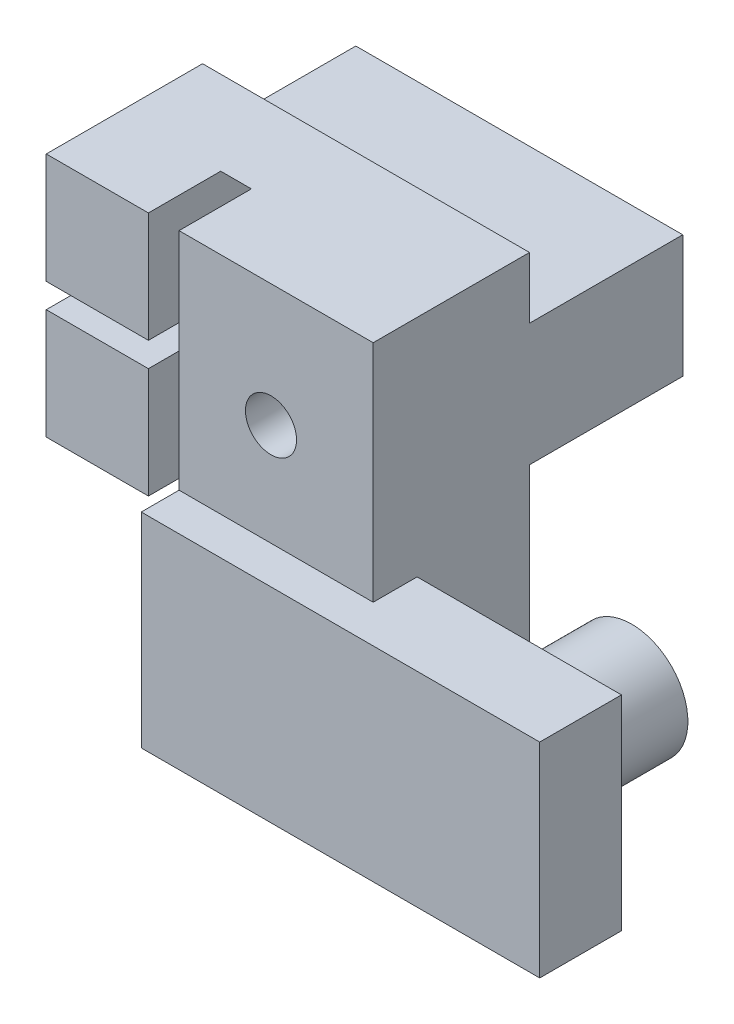
ISO-10303-21;
HEADER;
FILE_DESCRIPTION(('STEP AP214'),'2;1');
FILE_NAME('part.step','',(''),(''),'','','');
FILE_SCHEMA(('AUTOMOTIVE_DESIGN { 1 0 10303 214 1 1 1 1 }'));
ENDSEC;
DATA;
#1=APPLICATION_CONTEXT('core data for automotive mechanical design processes');
#2=APPLICATION_PROTOCOL_DEFINITION('international standard','automotive_design',2000,#1);
#3=PRODUCT_CONTEXT('',#1,'mechanical');
#4=PRODUCT('Part','Part','',(#3));
#5=PRODUCT_RELATED_PRODUCT_CATEGORY('part','',(#4));
#6=PRODUCT_DEFINITION_FORMATION('','',#4);
#7=PRODUCT_DEFINITION_CONTEXT('part definition',#1,'design');
#8=PRODUCT_DEFINITION('design','',#6,#7);
#9=PRODUCT_DEFINITION_SHAPE('','',#8);
#10=(LENGTH_UNIT() NAMED_UNIT(*) SI_UNIT(.MILLI.,.METRE.));
#11=(NAMED_UNIT(*) PLANE_ANGLE_UNIT() SI_UNIT($,.RADIAN.));
#12=(NAMED_UNIT(*) SI_UNIT($,.STERADIAN.) SOLID_ANGLE_UNIT());
#13=UNCERTAINTY_MEASURE_WITH_UNIT(LENGTH_MEASURE(1.E-05),#10,'distance_accuracy_value','');
#14=(GEOMETRIC_REPRESENTATION_CONTEXT(3) GLOBAL_UNCERTAINTY_ASSIGNED_CONTEXT((#13)) GLOBAL_UNIT_ASSIGNED_CONTEXT((#10,
#11,#12)) REPRESENTATION_CONTEXT('',''));
#15=CARTESIAN_POINT('',(0.,0.,0.));
#16=DIRECTION('',(0.,0.,1.));
#17=DIRECTION('',(1.,0.,0.));
#18=AXIS2_PLACEMENT_3D('',#15,#16,#17);
#19=CARTESIAN_POINT('',(-21.5996936960818,19.,27.65));
#20=DIRECTION('',(0.,1.,0.));
#21=DIRECTION('',(0.,0.,1.));
#22=AXIS2_PLACEMENT_3D('',#19,#20,#21);
#23=PLANE('',#22);
#24=DIRECTION('',(0.,0.,-1.));
#25=VECTOR('',#24,1.);
#26=CARTESIAN_POINT('',(-15.0996936960818,19.,7.65));
#27=LINE('',#26,#25);
#28=CARTESIAN_POINT('',(-15.0996936960818,19.,4.11123412892984));
#29=VERTEX_POINT('',#28);
#30=CARTESIAN_POINT('',(-15.0996936960818,19.,0.));
#31=VERTEX_POINT('',#30);
#32=EDGE_CURVE('E11',#29,#31,#27,.T.);
#33=ORIENTED_EDGE('',*,*,#32,.F.);
#34=DIRECTION('',(-1.,0.,0.));
#35=VECTOR('',#34,1.);
#36=CARTESIAN_POINT('',(-15.0996936960818,19.,4.11123412892984));
#37=LINE('',#36,#35);
#38=CARTESIAN_POINT('',(-16.5996936960818,19.,4.11123412892984));
#39=VERTEX_POINT('',#38);
#40=EDGE_CURVE('E299',#29,#39,#37,.T.);
#41=ORIENTED_EDGE('',*,*,#40,.T.);
#42=DIRECTION('',(0.,0.,1.));
#43=VECTOR('',#42,1.);
#44=CARTESIAN_POINT('',(-16.5996936960818,19.,27.65));
#45=LINE('',#44,#43);
#46=CARTESIAN_POINT('',(-16.5996936960818,19.,7.65));
#47=VERTEX_POINT('',#46);
#48=EDGE_CURVE('E290',#39,#47,#45,.T.);
#49=ORIENTED_EDGE('',*,*,#48,.T.);
#50=DIRECTION('',(1.,0.,0.));
#51=VECTOR('',#50,1.);
#52=CARTESIAN_POINT('',(-21.5996936960818,19.,7.65));
#53=LINE('',#52,#51);
#54=CARTESIAN_POINT('',(-21.5996936960818,19.,7.65));
#55=VERTEX_POINT('',#54);
#56=EDGE_CURVE('E348',#55,#47,#53,.T.);
#57=ORIENTED_EDGE('',*,*,#56,.F.);
#58=DIRECTION('',(0.,0.,-1.));
#59=VECTOR('',#58,1.);
#60=CARTESIAN_POINT('',(-21.5996936960818,19.,27.65));
#61=LINE('',#60,#59);
#62=CARTESIAN_POINT('',(-21.5996936960818,19.,0.));
#63=VERTEX_POINT('',#62);
#64=EDGE_CURVE('E340',#55,#63,#61,.T.);
#65=ORIENTED_EDGE('',*,*,#64,.T.);
#66=DIRECTION('',(1.,0.,0.));
#67=VECTOR('',#66,1.);
#68=CARTESIAN_POINT('',(-21.5996936960818,19.,0.));
#69=LINE('',#68,#67);
#70=EDGE_CURVE('E338',#63,#31,#69,.T.);
#71=ORIENTED_EDGE('',*,*,#70,.T.);
#72=EDGE_LOOP('',(#33,#41,#49,#57,#65,#71));
#73=FACE_BOUND('',#72,.T.);
#74=ADVANCED_FACE('F45',(#73),#23,.F.);
#75=CARTESIAN_POINT('',(0.,0.,0.));
#76=DIRECTION('',(0.,0.,-1.));
#77=DIRECTION('',(-1.,0.,0.));
#78=AXIS2_PLACEMENT_3D('',#75,#76,#77);
#79=PLANE('',#78);
#80=DIRECTION('',(1.,0.,0.));
#81=VECTOR('',#80,1.);
#82=CARTESIAN_POINT('',(-5.59969369608177,28.,0.));
#83=LINE('',#82,#81);
#84=CARTESIAN_POINT('',(-21.5996936960818,28.,0.));
#85=VERTEX_POINT('',#84);
#86=CARTESIAN_POINT('',(-5.59969369608177,28.,0.));
#87=VERTEX_POINT('',#86);
#88=EDGE_CURVE('E261',#85,#87,#83,.T.);
#89=ORIENTED_EDGE('',*,*,#88,.F.);
#90=DIRECTION('',(0.,-1.,0.));
#91=VECTOR('',#90,1.);
#92=CARTESIAN_POINT('',(-21.5996936960818,19.,0.));
#93=LINE('',#92,#91);
#94=CARTESIAN_POINT('',(-21.5996936960818,31.,0.));
#95=VERTEX_POINT('',#94);
#96=EDGE_CURVE('E341',#95,#85,#93,.T.);
#97=ORIENTED_EDGE('',*,*,#96,.F.);
#98=DIRECTION('',(-1.,0.,0.));
#99=VECTOR('',#98,1.);
#100=CARTESIAN_POINT('',(-21.5996936960818,31.,0.));
#101=LINE('',#100,#99);
#102=CARTESIAN_POINT('',(-5.59969369608177,31.,0.));
#103=VERTEX_POINT('',#102);
#104=EDGE_CURVE('E330',#103,#95,#101,.T.);
#105=ORIENTED_EDGE('',*,*,#104,.F.);
#106=DIRECTION('',(0.,1.,0.));
#107=VECTOR('',#106,1.);
#108=CARTESIAN_POINT('',(-5.59969369608177,19.,0.));
#109=LINE('',#108,#107);
#110=EDGE_CURVE('E69',#87,#103,#109,.T.);
#111=ORIENTED_EDGE('',*,*,#110,.F.);
#112=EDGE_LOOP('',(#89,#97,#105,#111));
#113=FACE_BOUND('',#112,.T.);
#114=ADVANCED_FACE('F413',(#113),#79,.T.);
#115=CARTESIAN_POINT('',(-21.5996936960818,31.,27.65));
#116=DIRECTION('',(0.,-1.,0.));
#117=DIRECTION('',(0.,0.,-1.));
#118=AXIS2_PLACEMENT_3D('',#115,#116,#117);
#119=PLANE('',#118);
#120=DIRECTION('',(0.,0.,-1.));
#121=VECTOR('',#120,1.);
#122=CARTESIAN_POINT('',(-15.0996936960818,31.,27.65));
#123=LINE('',#122,#121);
#124=CARTESIAN_POINT('',(-15.0996936960818,31.,7.65));
#125=VERTEX_POINT('',#124);
#126=CARTESIAN_POINT('',(-15.0996936960818,31.,4.11123412892984));
#127=VERTEX_POINT('',#126);
#128=EDGE_CURVE('E297',#125,#127,#123,.T.);
#129=ORIENTED_EDGE('',*,*,#128,.F.);
#130=DIRECTION('',(-1.,0.,0.));
#131=VECTOR('',#130,1.);
#132=CARTESIAN_POINT('',(-21.5996936960818,31.,7.65));
#133=LINE('',#132,#131);
#134=CARTESIAN_POINT('',(-5.59969369608177,31.,7.65));
#135=VERTEX_POINT('',#134);
#136=EDGE_CURVE('E355',#135,#125,#133,.T.);
#137=ORIENTED_EDGE('',*,*,#136,.F.);
#138=DIRECTION('',(0.,0.,-1.));
#139=VECTOR('',#138,1.);
#140=CARTESIAN_POINT('',(-5.59969369608177,31.,27.65));
#141=LINE('',#140,#139);
#142=EDGE_CURVE('E334',#135,#103,#141,.T.);
#143=ORIENTED_EDGE('',*,*,#142,.T.);
#144=ORIENTED_EDGE('',*,*,#104,.T.);
#145=DIRECTION('',(0.,0.,-1.));
#146=VECTOR('',#145,1.);
#147=CARTESIAN_POINT('',(-21.5996936960818,31.,27.65));
#148=LINE('',#147,#146);
#149=CARTESIAN_POINT('',(-21.5996936960818,31.,7.65));
#150=VERTEX_POINT('',#149);
#151=EDGE_CURVE('E323',#150,#95,#148,.T.);
#152=ORIENTED_EDGE('',*,*,#151,.F.);
#153=CARTESIAN_POINT('',(-16.5996936960818,31.,7.65));
#154=VERTEX_POINT('',#153);
#155=EDGE_CURVE('E333',#154,#150,#133,.T.);
#156=ORIENTED_EDGE('',*,*,#155,.F.);
#157=DIRECTION('',(0.,0.,-1.));
#158=VECTOR('',#157,1.);
#159=CARTESIAN_POINT('',(-16.5996936960818,31.,27.65));
#160=LINE('',#159,#158);
#161=CARTESIAN_POINT('',(-16.5996936960818,31.,4.11123412892984));
#162=VERTEX_POINT('',#161);
#163=EDGE_CURVE('E294',#154,#162,#160,.T.);
#164=ORIENTED_EDGE('',*,*,#163,.T.);
#165=DIRECTION('',(-1.,0.,0.));
#166=VECTOR('',#165,1.);
#167=CARTESIAN_POINT('',(-15.0996936960818,31.,4.11123412892984));
#168=LINE('',#167,#166);
#169=EDGE_CURVE('E49',#162,#127,#168,.F.);
#170=ORIENTED_EDGE('',*,*,#169,.T.);
#171=EDGE_LOOP('',(#129,#137,#143,#144,#152,#156,#164,#170));
#172=FACE_BOUND('',#171,.T.);
#173=ADVANCED_FACE('F368',(#172),#119,.F.);
#174=CARTESIAN_POINT('',(-94.7383382518,25.35,7.65));
#175=DIRECTION('',(0.,0.,1.));
#176=DIRECTION('',(0.,1.,0.));
#177=AXIS2_PLACEMENT_3D('',#174,#175,#176);
#178=PLANE('',#177);
#179=DIRECTION('',(-1.,0.,0.));
#180=VECTOR('',#179,1.);
#181=CARTESIAN_POINT('',(-94.7383382518,20.,7.65));
#182=LINE('',#181,#180);
#183=CARTESIAN_POINT('',(-5.59969369608177,20.,7.65));
#184=VERTEX_POINT('',#183);
#185=CARTESIAN_POINT('',(-15.0996936960818,20.,7.65));
#186=VERTEX_POINT('',#185);
#187=EDGE_CURVE('E231',#184,#186,#182,.T.);
#188=ORIENTED_EDGE('',*,*,#187,.F.);
#189=DIRECTION('',(0.,1.,0.));
#190=VECTOR('',#189,1.);
#191=CARTESIAN_POINT('',(-5.59969369608177,19.,7.65));
#192=LINE('',#191,#190);
#193=EDGE_CURVE('E345',#184,#135,#192,.T.);
#194=ORIENTED_EDGE('',*,*,#193,.T.);
#195=ORIENTED_EDGE('',*,*,#136,.T.);
#196=DIRECTION('',(0.,-1.,0.));
#197=VECTOR('',#196,1.);
#198=CARTESIAN_POINT('',(-15.0996936960818,25.35,7.65));
#199=LINE('',#198,#197);
#200=EDGE_CURVE('E347',#125,#186,#199,.T.);
#201=ORIENTED_EDGE('',*,*,#200,.T.);
#202=EDGE_LOOP('',(#188,#194,#195,#201));
#203=FACE_BOUND('',#202,.T.);
#204=CARTESIAN_POINT('',(-10.5996936960818,25.,7.65));
#205=DIRECTION('',(0.,0.,-1.));
#206=DIRECTION('',(-1.,0.,0.));
#207=AXIS2_PLACEMENT_3D('',#204,#205,#206);
#208=CIRCLE('',#207,1.25);
#209=CARTESIAN_POINT('',(-11.8496936960818,25.,7.65));
#210=VERTEX_POINT('',#209);
#211=EDGE_CURVE('E245',#210,#210,#208,.T.);
#212=ORIENTED_EDGE('',*,*,#211,.T.);
#213=EDGE_LOOP('',(#212));
#214=FACE_BOUND('',#213,.T.);
#215=ADVANCED_FACE('F409',(#203,#214),#178,.T.);
#216=DIRECTION('',(0.,-1.,0.));
#217=VECTOR('',#216,1.);
#218=CARTESIAN_POINT('',(-16.5996936960818,25.35,7.65));
#219=LINE('',#218,#217);
#220=CARTESIAN_POINT('',(-16.5996936960818,25.6,7.65));
#221=VERTEX_POINT('',#220);
#222=EDGE_CURVE('E291',#154,#221,#219,.T.);
#223=ORIENTED_EDGE('',*,*,#222,.F.);
#224=ORIENTED_EDGE('',*,*,#155,.T.);
#225=DIRECTION('',(0.,-1.,0.));
#226=VECTOR('',#225,1.);
#227=CARTESIAN_POINT('',(-21.5996936960818,19.,7.65));
#228=LINE('',#227,#226);
#229=CARTESIAN_POINT('',(-21.5996936960818,25.6,7.65));
#230=VERTEX_POINT('',#229);
#231=EDGE_CURVE('E351',#150,#230,#228,.T.);
#232=ORIENTED_EDGE('',*,*,#231,.T.);
#233=DIRECTION('',(-1.,0.,0.));
#234=VECTOR('',#233,1.);
#235=CARTESIAN_POINT('',(-21.5996936960818,25.6,7.65));
#236=LINE('',#235,#234);
#237=EDGE_CURVE('E307',#221,#230,#236,.T.);
#238=ORIENTED_EDGE('',*,*,#237,.F.);
#239=EDGE_LOOP('',(#223,#224,#232,#238));
#240=FACE_BOUND('',#239,.T.);
#241=ADVANCED_FACE('F448',(#240),#178,.T.);
#242=CARTESIAN_POINT('',(-21.5996936960818,19.,27.65));
#243=DIRECTION('',(1.,0.,0.));
#244=DIRECTION('',(0.,0.,-1.));
#245=AXIS2_PLACEMENT_3D('',#242,#243,#244);
#246=PLANE('',#245);
#247=DIRECTION('',(0.,-1.,0.));
#248=VECTOR('',#247,1.);
#249=CARTESIAN_POINT('',(-21.5996936960818,25.6,3.15));
#250=LINE('',#249,#248);
#251=CARTESIAN_POINT('',(-21.5996936960818,25.6,3.15));
#252=VERTEX_POINT('',#251);
#253=CARTESIAN_POINT('',(-21.5996936960818,24.4,3.15));
#254=VERTEX_POINT('',#253);
#255=EDGE_CURVE('E303',#252,#254,#250,.T.);
#256=ORIENTED_EDGE('',*,*,#255,.F.);
#257=DIRECTION('',(0.,0.,1.));
#258=VECTOR('',#257,1.);
#259=CARTESIAN_POINT('',(-21.5996936960818,25.6,3.15));
#260=LINE('',#259,#258);
#261=EDGE_CURVE('E320',#252,#230,#260,.T.);
#262=ORIENTED_EDGE('',*,*,#261,.T.);
#263=ORIENTED_EDGE('',*,*,#231,.F.);
#264=ORIENTED_EDGE('',*,*,#151,.T.);
#265=ORIENTED_EDGE('',*,*,#96,.T.);
#266=DIRECTION('',(0.,0.,1.));
#267=VECTOR('',#266,1.);
#268=CARTESIAN_POINT('',(-21.5996936960818,28.,-7.5));
#269=LINE('',#268,#267);
#270=CARTESIAN_POINT('',(-21.5996936960818,28.,-7.5));
#271=VERTEX_POINT('',#270);
#272=EDGE_CURVE('E273',#271,#85,#269,.T.);
#273=ORIENTED_EDGE('',*,*,#272,.F.);
#274=DIRECTION('',(0.,1.,0.));
#275=VECTOR('',#274,1.);
#276=CARTESIAN_POINT('',(-21.5996936960818,28.,-7.5));
#277=LINE('',#276,#275);
#278=CARTESIAN_POINT('',(-21.5996936960818,22.,-7.5));
#279=VERTEX_POINT('',#278);
#280=EDGE_CURVE('E263',#279,#271,#277,.T.);
#281=ORIENTED_EDGE('',*,*,#280,.F.);
#282=DIRECTION('',(0.,0.,1.));
#283=VECTOR('',#282,1.);
#284=CARTESIAN_POINT('',(-21.5996936960818,22.,-7.5));
#285=LINE('',#284,#283);
#286=CARTESIAN_POINT('',(-21.5996936960818,22.,0.));
#287=VERTEX_POINT('',#286);
#288=EDGE_CURVE('E276',#279,#287,#285,.T.);
#289=ORIENTED_EDGE('',*,*,#288,.T.);
#290=EDGE_CURVE('E344',#287,#63,#93,.T.);
#291=ORIENTED_EDGE('',*,*,#290,.T.);
#292=ORIENTED_EDGE('',*,*,#64,.F.);
#293=CARTESIAN_POINT('',(-21.5996936960818,24.4,7.65));
#294=VERTEX_POINT('',#293);
#295=EDGE_CURVE('E354',#294,#55,#228,.T.);
#296=ORIENTED_EDGE('',*,*,#295,.F.);
#297=DIRECTION('',(0.,0.,1.));
#298=VECTOR('',#297,1.);
#299=CARTESIAN_POINT('',(-21.5996936960818,24.4,3.15));
#300=LINE('',#299,#298);
#301=EDGE_CURVE('E316',#254,#294,#300,.T.);
#302=ORIENTED_EDGE('',*,*,#301,.F.);
#303=EDGE_LOOP('',(#256,#262,#263,#264,#265,#273,#281,#289,#291,#292,#296,#302));
#304=FACE_BOUND('',#303,.T.);
#305=ADVANCED_FACE('F389',(#304),#246,.F.);
#306=CARTESIAN_POINT('',(-5.59969369608177,19.,27.65));
#307=DIRECTION('',(-1.,0.,0.));
#308=DIRECTION('',(0.,0.,1.));
#309=AXIS2_PLACEMENT_3D('',#306,#307,#308);
#310=PLANE('',#309);
#311=DIRECTION('',(0.,0.,-1.));
#312=VECTOR('',#311,1.);
#313=CARTESIAN_POINT('',(-5.59969369608177,20.,27.65));
#314=LINE('',#313,#312);
#315=CARTESIAN_POINT('',(-5.59969369608177,20.,5.5));
#316=VERTEX_POINT('',#315);
#317=EDGE_CURVE('E229',#184,#316,#314,.T.);
#318=ORIENTED_EDGE('',*,*,#317,.T.);
#319=DIRECTION('',(0.,-1.,0.));
#320=VECTOR('',#319,1.);
#321=CARTESIAN_POINT('',(-5.59969369608177,19.,5.5));
#322=LINE('',#321,#320);
#323=CARTESIAN_POINT('',(-5.59969369608177,9.99999999999999,5.5));
#324=VERTEX_POINT('',#323);
#325=EDGE_CURVE('E192',#316,#324,#322,.T.);
#326=ORIENTED_EDGE('',*,*,#325,.T.);
#327=DIRECTION('',(0.,0.,1.));
#328=VECTOR('',#327,1.);
#329=CARTESIAN_POINT('',(-5.59969369608177,9.99999999999999,7.65));
#330=LINE('',#329,#328);
#331=CARTESIAN_POINT('',(-5.59969369608177,9.99999999999999,0.));
#332=VERTEX_POINT('',#331);
#333=EDGE_CURVE('E238',#332,#324,#330,.T.);
#334=ORIENTED_EDGE('',*,*,#333,.F.);
#335=CARTESIAN_POINT('',(-5.59969369608177,22.,0.));
#336=VERTEX_POINT('',#335);
#337=EDGE_CURVE('E335',#332,#336,#109,.T.);
#338=ORIENTED_EDGE('',*,*,#337,.T.);
#339=DIRECTION('',(0.,0.,1.));
#340=VECTOR('',#339,1.);
#341=CARTESIAN_POINT('',(-5.59969369608178,22.,-7.5));
#342=LINE('',#341,#340);
#343=CARTESIAN_POINT('',(-5.59969369608178,22.,-7.5));
#344=VERTEX_POINT('',#343);
#345=EDGE_CURVE('E279',#344,#336,#342,.T.);
#346=ORIENTED_EDGE('',*,*,#345,.F.);
#347=DIRECTION('',(0.,-1.,0.));
#348=VECTOR('',#347,1.);
#349=CARTESIAN_POINT('',(-5.59969369608177,28.,-7.5));
#350=LINE('',#349,#348);
#351=CARTESIAN_POINT('',(-5.59969369608177,28.,-7.5));
#352=VERTEX_POINT('',#351);
#353=EDGE_CURVE('E257',#352,#344,#350,.T.);
#354=ORIENTED_EDGE('',*,*,#353,.F.);
#355=DIRECTION('',(0.,0.,1.));
#356=VECTOR('',#355,1.);
#357=CARTESIAN_POINT('',(-5.59969369608177,28.,-7.5));
#358=LINE('',#357,#356);
#359=EDGE_CURVE('E267',#352,#87,#358,.T.);
#360=ORIENTED_EDGE('',*,*,#359,.T.);
#361=ORIENTED_EDGE('',*,*,#110,.T.);
#362=ORIENTED_EDGE('',*,*,#142,.F.);
#363=ORIENTED_EDGE('',*,*,#193,.F.);
#364=EDGE_LOOP('',(#318,#326,#334,#338,#346,#354,#360,#361,#362,#363));
#365=FACE_BOUND('',#364,.T.);
#366=ADVANCED_FACE('F406',(#365),#310,.F.);
#367=DIRECTION('',(-1.,0.,0.));
#368=VECTOR('',#367,1.);
#369=CARTESIAN_POINT('',(-5.59969369608178,22.,0.));
#370=LINE('',#369,#368);
#371=EDGE_CURVE('E256',#336,#287,#370,.T.);
#372=ORIENTED_EDGE('',*,*,#371,.F.);
#373=ORIENTED_EDGE('',*,*,#337,.F.);
#374=DIRECTION('',(1.,0.,0.));
#375=VECTOR('',#374,1.);
#376=CARTESIAN_POINT('',(-15.0996936960818,9.99999999999999,0.));
#377=LINE('',#376,#375);
#378=CARTESIAN_POINT('',(-15.0996936960818,9.99999999999999,0.));
#379=VERTEX_POINT('',#378);
#380=EDGE_CURVE('E235',#379,#332,#377,.T.);
#381=ORIENTED_EDGE('',*,*,#380,.F.);
#382=DIRECTION('',(0.,1.,0.));
#383=VECTOR('',#382,1.);
#384=CARTESIAN_POINT('',(-15.0996936960818,9.99999999999999,0.));
#385=LINE('',#384,#383);
#386=EDGE_CURVE('E240',#379,#31,#385,.T.);
#387=ORIENTED_EDGE('',*,*,#386,.T.);
#388=ORIENTED_EDGE('',*,*,#70,.F.);
#389=ORIENTED_EDGE('',*,*,#290,.F.);
#390=EDGE_LOOP('',(#372,#373,#381,#387,#388,#389));
#391=FACE_BOUND('',#390,.T.);
#392=ADVANCED_FACE('F392',(#391),#79,.T.);
#393=CARTESIAN_POINT('',(-16.5996936960818,24.4,7.65));
#394=VERTEX_POINT('',#393);
#395=EDGE_CURVE('E286',#394,#47,#219,.T.);
#396=ORIENTED_EDGE('',*,*,#395,.F.);
#397=DIRECTION('',(1.,0.,0.));
#398=VECTOR('',#397,1.);
#399=CARTESIAN_POINT('',(-21.5996936960818,24.4,7.65));
#400=LINE('',#399,#398);
#401=EDGE_CURVE('E302',#294,#394,#400,.T.);
#402=ORIENTED_EDGE('',*,*,#401,.F.);
#403=ORIENTED_EDGE('',*,*,#295,.T.);
#404=ORIENTED_EDGE('',*,*,#56,.T.);
#405=EDGE_LOOP('',(#396,#402,#403,#404));
#406=FACE_BOUND('',#405,.T.);
#407=ADVANCED_FACE('F47',(#406),#178,.T.);
#408=CARTESIAN_POINT('',(-21.5996936960818,25.6,3.15));
#409=DIRECTION('',(0.,1.,0.));
#410=DIRECTION('',(0.,0.,1.));
#411=AXIS2_PLACEMENT_3D('',#408,#409,#410);
#412=PLANE('',#411);
#413=ORIENTED_EDGE('',*,*,#237,.T.);
#414=ORIENTED_EDGE('',*,*,#261,.F.);
#415=DIRECTION('',(-1.,0.,0.));
#416=VECTOR('',#415,1.);
#417=CARTESIAN_POINT('',(-21.5996936960818,25.6,3.15));
#418=LINE('',#417,#416);
#419=CARTESIAN_POINT('',(-16.5996936960818,25.6,3.15));
#420=VERTEX_POINT('',#419);
#421=EDGE_CURVE('E313',#420,#252,#418,.T.);
#422=ORIENTED_EDGE('',*,*,#421,.F.);
#423=DIRECTION('',(0.,0.,1.));
#424=VECTOR('',#423,1.);
#425=CARTESIAN_POINT('',(-16.5996936960818,25.6,3.15));
#426=LINE('',#425,#424);
#427=EDGE_CURVE('E324',#420,#221,#426,.T.);
#428=ORIENTED_EDGE('',*,*,#427,.T.);
#429=EDGE_LOOP('',(#413,#414,#422,#428));
#430=FACE_BOUND('',#429,.T.);
#431=ADVANCED_FACE('F459',(#430),#412,.F.);
#432=CARTESIAN_POINT('',(-21.5996936960818,24.4,3.15));
#433=DIRECTION('',(0.,-1.,0.));
#434=DIRECTION('',(0.,0.,-1.));
#435=AXIS2_PLACEMENT_3D('',#432,#433,#434);
#436=PLANE('',#435);
#437=ORIENTED_EDGE('',*,*,#401,.T.);
#438=DIRECTION('',(0.,0.,1.));
#439=VECTOR('',#438,1.);
#440=CARTESIAN_POINT('',(-16.5996936960818,24.4,3.15));
#441=LINE('',#440,#439);
#442=CARTESIAN_POINT('',(-16.5996936960818,24.4,3.15));
#443=VERTEX_POINT('',#442);
#444=EDGE_CURVE('E327',#443,#394,#441,.T.);
#445=ORIENTED_EDGE('',*,*,#444,.F.);
#446=DIRECTION('',(1.,0.,0.));
#447=VECTOR('',#446,1.);
#448=CARTESIAN_POINT('',(-21.5996936960818,24.4,3.15));
#449=LINE('',#448,#447);
#450=EDGE_CURVE('E306',#254,#443,#449,.T.);
#451=ORIENTED_EDGE('',*,*,#450,.F.);
#452=ORIENTED_EDGE('',*,*,#301,.T.);
#453=EDGE_LOOP('',(#437,#445,#451,#452));
#454=FACE_BOUND('',#453,.T.);
#455=ADVANCED_FACE('F463',(#454),#436,.F.);
#456=CARTESIAN_POINT('',(0.,0.,3.15));
#457=DIRECTION('',(0.,0.,1.));
#458=DIRECTION('',(1.,0.,0.));
#459=AXIS2_PLACEMENT_3D('',#456,#457,#458);
#460=PLANE('',#459);
#461=ORIENTED_EDGE('',*,*,#255,.T.);
#462=ORIENTED_EDGE('',*,*,#450,.T.);
#463=DIRECTION('',(0.,1.,0.));
#464=VECTOR('',#463,1.);
#465=CARTESIAN_POINT('',(-16.5996936960818,25.6,3.15));
#466=LINE('',#465,#464);
#467=EDGE_CURVE('E310',#443,#420,#466,.T.);
#468=ORIENTED_EDGE('',*,*,#467,.T.);
#469=ORIENTED_EDGE('',*,*,#421,.T.);
#470=EDGE_LOOP('',(#461,#462,#468,#469));
#471=FACE_BOUND('',#470,.T.);
#472=ADVANCED_FACE('F484',(#471),#460,.T.);
#473=CARTESIAN_POINT('',(-15.0996936960818,25.,8.));
#474=DIRECTION('',(-1.,0.,0.));
#475=DIRECTION('',(0.,0.,1.));
#476=AXIS2_PLACEMENT_3D('',#473,#474,#475);
#477=CYLINDRICAL_SURFACE('',#476,7.15);
#478=CARTESIAN_POINT('',(-15.0996936960818,25.,8.));
#479=DIRECTION('',(-1.,0.,0.));
#480=DIRECTION('',(0.,0.,1.));
#481=AXIS2_PLACEMENT_3D('',#478,#479,#480);
#482=CIRCLE('',#481,7.15);
#483=EDGE_CURVE('E283',#127,#29,#482,.T.);
#484=ORIENTED_EDGE('',*,*,#483,.F.);
#485=ORIENTED_EDGE('',*,*,#169,.F.);
#486=CARTESIAN_POINT('',(-16.5996936960818,25.,8.));
#487=DIRECTION('',(-1.,0.,0.));
#488=DIRECTION('',(0.,0.,1.));
#489=AXIS2_PLACEMENT_3D('',#486,#487,#488);
#490=CIRCLE('',#489,7.15);
#491=EDGE_CURVE('E282',#162,#39,#490,.T.);
#492=ORIENTED_EDGE('',*,*,#491,.T.);
#493=ORIENTED_EDGE('',*,*,#40,.F.);
#494=EDGE_LOOP('',(#484,#485,#492,#493));
#495=FACE_BOUND('',#494,.T.);
#496=ADVANCED_FACE('F374',(#495),#477,.F.);
#497=CARTESIAN_POINT('',(-15.0996936960818,25.,8.));
#498=DIRECTION('',(-1.,0.,0.));
#499=DIRECTION('',(0.,0.,1.));
#500=AXIS2_PLACEMENT_3D('',#497,#498,#499);
#501=PLANE('',#500);
#502=ORIENTED_EDGE('',*,*,#386,.F.);
#503=DIRECTION('',(0.,0.,-1.));
#504=VECTOR('',#503,1.);
#505=CARTESIAN_POINT('',(-15.0996936960818,9.99999999999999,7.65));
#506=LINE('',#505,#504);
#507=CARTESIAN_POINT('',(-15.0996936960818,9.99999999999999,9.5));
#508=VERTEX_POINT('',#507);
#509=EDGE_CURVE('E233',#508,#379,#506,.T.);
#510=ORIENTED_EDGE('',*,*,#509,.F.);
#511=DIRECTION('',(0.,-1.,0.));
#512=VECTOR('',#511,1.);
#513=CARTESIAN_POINT('',(-15.0996936960818,9.99999999999999,9.5));
#514=LINE('',#513,#512);
#515=CARTESIAN_POINT('',(-15.0996936960818,20.,9.5));
#516=VERTEX_POINT('',#515);
#517=EDGE_CURVE('E195',#516,#508,#514,.T.);
#518=ORIENTED_EDGE('',*,*,#517,.F.);
#519=DIRECTION('',(0.,0.,1.));
#520=VECTOR('',#519,1.);
#521=CARTESIAN_POINT('',(-15.0996936960818,20.,5.5));
#522=LINE('',#521,#520);
#523=EDGE_CURVE('E219',#186,#516,#522,.T.);
#524=ORIENTED_EDGE('',*,*,#523,.F.);
#525=ORIENTED_EDGE('',*,*,#200,.F.);
#526=ORIENTED_EDGE('',*,*,#128,.T.);
#527=ORIENTED_EDGE('',*,*,#483,.T.);
#528=ORIENTED_EDGE('',*,*,#32,.T.);
#529=EDGE_LOOP('',(#502,#510,#518,#524,#525,#526,#527,#528));
#530=FACE_BOUND('',#529,.T.);
#531=ADVANCED_FACE('F396',(#530),#501,.T.);
#532=CARTESIAN_POINT('',(-16.5996936960818,25.,8.));
#533=DIRECTION('',(-1.,0.,0.));
#534=DIRECTION('',(0.,0.,1.));
#535=AXIS2_PLACEMENT_3D('',#532,#533,#534);
#536=PLANE('',#535);
#537=ORIENTED_EDGE('',*,*,#222,.T.);
#538=ORIENTED_EDGE('',*,*,#427,.F.);
#539=ORIENTED_EDGE('',*,*,#467,.F.);
#540=ORIENTED_EDGE('',*,*,#444,.T.);
#541=ORIENTED_EDGE('',*,*,#395,.T.);
#542=ORIENTED_EDGE('',*,*,#48,.F.);
#543=ORIENTED_EDGE('',*,*,#491,.F.);
#544=ORIENTED_EDGE('',*,*,#163,.F.);
#545=EDGE_LOOP('',(#537,#538,#539,#540,#541,#542,#543,#544));
#546=FACE_BOUND('',#545,.T.);
#547=ADVANCED_FACE('F377',(#546),#536,.F.);
#548=CARTESIAN_POINT('',(-5.59969369608178,22.,-7.5));
#549=DIRECTION('',(0.,1.,0.));
#550=DIRECTION('',(0.,0.,1.));
#551=AXIS2_PLACEMENT_3D('',#548,#549,#550);
#552=PLANE('',#551);
#553=ORIENTED_EDGE('',*,*,#371,.T.);
#554=ORIENTED_EDGE('',*,*,#288,.F.);
#555=DIRECTION('',(-1.,0.,0.));
#556=VECTOR('',#555,1.);
#557=CARTESIAN_POINT('',(-5.59969369608178,22.,-7.5));
#558=LINE('',#557,#556);
#559=EDGE_CURVE('E260',#344,#279,#558,.T.);
#560=ORIENTED_EDGE('',*,*,#559,.F.);
#561=ORIENTED_EDGE('',*,*,#345,.T.);
#562=EDGE_LOOP('',(#553,#554,#560,#561));
#563=FACE_BOUND('',#562,.T.);
#564=ADVANCED_FACE('F427',(#563),#552,.F.);
#565=CARTESIAN_POINT('',(-5.59969369608177,28.,-7.5));
#566=DIRECTION('',(0.,-1.,0.));
#567=DIRECTION('',(0.,0.,-1.));
#568=AXIS2_PLACEMENT_3D('',#565,#566,#567);
#569=PLANE('',#568);
#570=ORIENTED_EDGE('',*,*,#88,.T.);
#571=ORIENTED_EDGE('',*,*,#359,.F.);
#572=DIRECTION('',(1.,0.,0.));
#573=VECTOR('',#572,1.);
#574=CARTESIAN_POINT('',(-5.59969369608177,28.,-7.5));
#575=LINE('',#574,#573);
#576=EDGE_CURVE('E265',#271,#352,#575,.T.);
#577=ORIENTED_EDGE('',*,*,#576,.F.);
#578=ORIENTED_EDGE('',*,*,#272,.T.);
#579=EDGE_LOOP('',(#570,#571,#577,#578));
#580=FACE_BOUND('',#579,.T.);
#581=ADVANCED_FACE('F419',(#580),#569,.F.);
#582=CARTESIAN_POINT('',(0.,0.,-7.5));
#583=DIRECTION('',(0.,0.,-1.));
#584=DIRECTION('',(-1.,0.,0.));
#585=AXIS2_PLACEMENT_3D('',#582,#583,#584);
#586=PLANE('',#585);
#587=CARTESIAN_POINT('',(-10.5996936960818,25.,-7.5));
#588=DIRECTION('',(0.,0.,-1.));
#589=DIRECTION('',(-1.,0.,0.));
#590=AXIS2_PLACEMENT_3D('',#587,#588,#589);
#591=CIRCLE('',#590,2.25);
#592=CARTESIAN_POINT('',(-12.8496936960818,25.,-7.5));
#593=VERTEX_POINT('',#592);
#594=EDGE_CURVE('E248',#593,#593,#591,.T.);
#595=ORIENTED_EDGE('',*,*,#594,.F.);
#596=EDGE_LOOP('',(#595));
#597=FACE_BOUND('',#596,.T.);
#598=ORIENTED_EDGE('',*,*,#353,.T.);
#599=ORIENTED_EDGE('',*,*,#559,.T.);
#600=ORIENTED_EDGE('',*,*,#280,.T.);
#601=ORIENTED_EDGE('',*,*,#576,.T.);
#602=EDGE_LOOP('',(#598,#599,#600,#601));
#603=FACE_BOUND('',#602,.T.);
#604=ADVANCED_FACE('F423',(#597,#603),#586,.T.);
#605=CARTESIAN_POINT('',(-10.5996936960818,25.,6.36396103067893));
#606=DIRECTION('',(0.,0.,-1.));
#607=DIRECTION('',(-1.,0.,0.));
#608=AXIS2_PLACEMENT_3D('',#605,#606,#607);
#609=CYLINDRICAL_SURFACE('',#608,2.25);
#610=CARTESIAN_POINT('',(-10.5996936960818,25.,0.));
#611=DIRECTION('',(0.,0.,-1.));
#612=DIRECTION('',(-1.,0.,0.));
#613=AXIS2_PLACEMENT_3D('',#610,#611,#612);
#614=CIRCLE('',#613,2.25);
#615=CARTESIAN_POINT('',(-12.8496936960818,25.,0.));
#616=VERTEX_POINT('',#615);
#617=EDGE_CURVE('E253',#616,#616,#614,.F.);
#618=ORIENTED_EDGE('',*,*,#617,.T.);
#619=EDGE_LOOP('',(#618));
#620=FACE_BOUND('',#619,.T.);
#621=ORIENTED_EDGE('',*,*,#594,.T.);
#622=EDGE_LOOP('',(#621));
#623=FACE_BOUND('',#622,.T.);
#624=ADVANCED_FACE('F520',(#620,#623),#609,.F.);
#625=CARTESIAN_POINT('',(0.,0.,0.));
#626=DIRECTION('',(0.,0.,-1.));
#627=DIRECTION('',(-1.,0.,0.));
#628=AXIS2_PLACEMENT_3D('',#625,#626,#627);
#629=PLANE('',#628);
#630=CARTESIAN_POINT('',(-10.5996936960818,25.,0.));
#631=DIRECTION('',(0.,0.,-1.));
#632=DIRECTION('',(-1.,0.,0.));
#633=AXIS2_PLACEMENT_3D('',#630,#631,#632);
#634=CIRCLE('',#633,1.25);
#635=CARTESIAN_POINT('',(-11.8496936960818,25.,0.));
#636=VERTEX_POINT('',#635);
#637=EDGE_CURVE('E244',#636,#636,#634,.T.);
#638=ORIENTED_EDGE('',*,*,#637,.F.);
#639=EDGE_LOOP('',(#638));
#640=FACE_BOUND('',#639,.T.);
#641=ORIENTED_EDGE('',*,*,#617,.F.);
#642=EDGE_LOOP('',(#641));
#643=FACE_BOUND('',#642,.T.);
#644=ADVANCED_FACE('F529',(#640,#643),#629,.T.);
#645=CARTESIAN_POINT('',(-10.5996936960818,25.,7.65));
#646=DIRECTION('',(0.,0.,-1.));
#647=DIRECTION('',(-1.,0.,0.));
#648=AXIS2_PLACEMENT_3D('',#645,#646,#647);
#649=CYLINDRICAL_SURFACE('',#648,1.25);
#650=ORIENTED_EDGE('',*,*,#211,.F.);
#651=EDGE_LOOP('',(#650));
#652=FACE_BOUND('',#651,.T.);
#653=ORIENTED_EDGE('',*,*,#637,.T.);
#654=EDGE_LOOP('',(#653));
#655=FACE_BOUND('',#654,.T.);
#656=ADVANCED_FACE('F538',(#652,#655),#649,.F.);
#657=CARTESIAN_POINT('',(0.,9.99999999999999,0.));
#658=DIRECTION('',(0.,-1.,0.));
#659=DIRECTION('',(0.,0.,-1.));
#660=AXIS2_PLACEMENT_3D('',#657,#658,#659);
#661=PLANE('',#660);
#662=DIRECTION('',(1.,0.,0.));
#663=VECTOR('',#662,1.);
#664=CARTESIAN_POINT('',(-15.0996936960818,9.99999999999999,9.5));
#665=LINE('',#664,#663);
#666=CARTESIAN_POINT('',(4.40030630391823,9.99999999999999,9.5));
#667=VERTEX_POINT('',#666);
#668=EDGE_CURVE('E225',#508,#667,#665,.T.);
#669=ORIENTED_EDGE('',*,*,#668,.F.);
#670=ORIENTED_EDGE('',*,*,#509,.T.);
#671=ORIENTED_EDGE('',*,*,#380,.T.);
#672=ORIENTED_EDGE('',*,*,#333,.T.);
#673=DIRECTION('',(1.,0.,0.));
#674=VECTOR('',#673,1.);
#675=CARTESIAN_POINT('',(-15.0996936960818,9.99999999999999,5.5));
#676=LINE('',#675,#674);
#677=CARTESIAN_POINT('',(4.40030630391823,9.99999999999999,5.5));
#678=VERTEX_POINT('',#677);
#679=EDGE_CURVE('E223',#324,#678,#676,.T.);
#680=ORIENTED_EDGE('',*,*,#679,.T.);
#681=DIRECTION('',(0.,0.,-1.));
#682=VECTOR('',#681,1.);
#683=CARTESIAN_POINT('',(4.40030630391823,9.99999999999999,5.5));
#684=LINE('',#683,#682);
#685=EDGE_CURVE('E209',#667,#678,#684,.T.);
#686=ORIENTED_EDGE('',*,*,#685,.F.);
#687=EDGE_LOOP('',(#669,#670,#671,#672,#680,#686));
#688=FACE_BOUND('',#687,.T.);
#689=ADVANCED_FACE('F403',(#688),#661,.T.);
#690=CARTESIAN_POINT('',(-15.0996936960818,9.99999999999999,5.5));
#691=DIRECTION('',(0.,0.,-1.));
#692=DIRECTION('',(-1.,0.,0.));
#693=AXIS2_PLACEMENT_3D('',#690,#691,#692);
#694=PLANE('',#693);
#695=CARTESIAN_POINT('',(-0.599693696081774,15.,5.5));
#696=DIRECTION('',(0.,0.,-1.));
#697=DIRECTION('',(-1.,0.,0.));
#698=AXIS2_PLACEMENT_3D('',#695,#696,#697);
#699=CIRCLE('',#698,2.75);
#700=CARTESIAN_POINT('',(-3.34969369608177,15.,5.5));
#701=VERTEX_POINT('',#700);
#702=EDGE_CURVE('E213',#701,#701,#699,.T.);
#703=ORIENTED_EDGE('',*,*,#702,.F.);
#704=EDGE_LOOP('',(#703));
#705=FACE_BOUND('',#704,.T.);
#706=ORIENTED_EDGE('',*,*,#325,.F.);
#707=DIRECTION('',(1.,0.,0.));
#708=VECTOR('',#707,1.);
#709=CARTESIAN_POINT('',(-15.0996936960818,20.,5.5));
#710=LINE('',#709,#708);
#711=CARTESIAN_POINT('',(4.40030630391823,20.,5.5));
#712=VERTEX_POINT('',#711);
#713=EDGE_CURVE('E61',#316,#712,#710,.T.);
#714=ORIENTED_EDGE('',*,*,#713,.T.);
#715=DIRECTION('',(0.,1.,0.));
#716=VECTOR('',#715,1.);
#717=CARTESIAN_POINT('',(4.40030630391823,9.99999999999999,5.5));
#718=LINE('',#717,#716);
#719=EDGE_CURVE('E190',#678,#712,#718,.T.);
#720=ORIENTED_EDGE('',*,*,#719,.F.);
#721=ORIENTED_EDGE('',*,*,#679,.F.);
#722=EDGE_LOOP('',(#706,#714,#720,#721));
#723=FACE_BOUND('',#722,.T.);
#724=ADVANCED_FACE('F188',(#705,#723),#694,.T.);
#725=CARTESIAN_POINT('',(-15.0996936960818,9.99999999999999,9.5));
#726=DIRECTION('',(0.,0.,1.));
#727=DIRECTION('',(0.,-1.,0.));
#728=AXIS2_PLACEMENT_3D('',#725,#726,#727);
#729=PLANE('',#728);
#730=ORIENTED_EDGE('',*,*,#668,.T.);
#731=DIRECTION('',(0.,-1.,0.));
#732=VECTOR('',#731,1.);
#733=CARTESIAN_POINT('',(4.40030630391823,9.99999999999999,9.5));
#734=LINE('',#733,#732);
#735=CARTESIAN_POINT('',(4.40030630391823,20.,9.5));
#736=VERTEX_POINT('',#735);
#737=EDGE_CURVE('E204',#736,#667,#734,.T.);
#738=ORIENTED_EDGE('',*,*,#737,.F.);
#739=DIRECTION('',(1.,0.,0.));
#740=VECTOR('',#739,1.);
#741=CARTESIAN_POINT('',(-15.0996936960818,20.,9.5));
#742=LINE('',#741,#740);
#743=EDGE_CURVE('E194',#516,#736,#742,.T.);
#744=ORIENTED_EDGE('',*,*,#743,.F.);
#745=ORIENTED_EDGE('',*,*,#517,.T.);
#746=EDGE_LOOP('',(#730,#738,#744,#745));
#747=FACE_BOUND('',#746,.T.);
#748=ADVANCED_FACE('F401',(#747),#729,.T.);
#749=CARTESIAN_POINT('',(-15.0996936960818,20.,5.5));
#750=DIRECTION('',(0.,1.,0.));
#751=DIRECTION('',(0.,0.,1.));
#752=AXIS2_PLACEMENT_3D('',#749,#750,#751);
#753=PLANE('',#752);
#754=ORIENTED_EDGE('',*,*,#317,.F.);
#755=ORIENTED_EDGE('',*,*,#187,.T.);
#756=ORIENTED_EDGE('',*,*,#523,.T.);
#757=ORIENTED_EDGE('',*,*,#743,.T.);
#758=DIRECTION('',(0.,0.,1.));
#759=VECTOR('',#758,1.);
#760=CARTESIAN_POINT('',(4.40030630391823,20.,5.5));
#761=LINE('',#760,#759);
#762=EDGE_CURVE('E198',#712,#736,#761,.T.);
#763=ORIENTED_EDGE('',*,*,#762,.F.);
#764=ORIENTED_EDGE('',*,*,#713,.F.);
#765=EDGE_LOOP('',(#754,#755,#756,#757,#763,#764));
#766=FACE_BOUND('',#765,.T.);
#767=ADVANCED_FACE('F199',(#766),#753,.T.);
#768=CARTESIAN_POINT('',(4.40030630391823,0.,0.));
#769=DIRECTION('',(1.,0.,0.));
#770=DIRECTION('',(0.,0.,-1.));
#771=AXIS2_PLACEMENT_3D('',#768,#769,#770);
#772=PLANE('',#771);
#773=ORIENTED_EDGE('',*,*,#719,.T.);
#774=ORIENTED_EDGE('',*,*,#762,.T.);
#775=ORIENTED_EDGE('',*,*,#737,.T.);
#776=ORIENTED_EDGE('',*,*,#685,.T.);
#777=EDGE_LOOP('',(#773,#774,#775,#776));
#778=FACE_BOUND('',#777,.T.);
#779=ADVANCED_FACE('F207',(#778),#772,.T.);
#780=CARTESIAN_POINT('',(-0.599693696081774,15.,0.));
#781=DIRECTION('',(0.,0.,1.));
#782=DIRECTION('',(1.,0.,0.));
#783=AXIS2_PLACEMENT_3D('',#780,#781,#782);
#784=CYLINDRICAL_SURFACE('',#783,2.75);
#785=CARTESIAN_POINT('',(-0.599693696081774,15.,0.));
#786=DIRECTION('',(0.,0.,-1.));
#787=DIRECTION('',(-1.,0.,0.));
#788=AXIS2_PLACEMENT_3D('',#785,#786,#787);
#789=CIRCLE('',#788,2.75);
#790=CARTESIAN_POINT('',(-3.34969369608177,15.,0.));
#791=VERTEX_POINT('',#790);
#792=EDGE_CURVE('E210',#791,#791,#789,.T.);
#793=ORIENTED_EDGE('',*,*,#792,.F.);
#794=EDGE_LOOP('',(#793));
#795=FACE_BOUND('',#794,.T.);
#796=ORIENTED_EDGE('',*,*,#702,.T.);
#797=EDGE_LOOP('',(#796));
#798=FACE_BOUND('',#797,.T.);
#799=ADVANCED_FACE('F589',(#795,#798),#784,.T.);
#800=CARTESIAN_POINT('',(-0.599693696081774,15.,0.));
#801=DIRECTION('',(0.,0.,-1.));
#802=DIRECTION('',(-1.,0.,0.));
#803=AXIS2_PLACEMENT_3D('',#800,#801,#802);
#804=PLANE('',#803);
#805=ORIENTED_EDGE('',*,*,#792,.T.);
#806=EDGE_LOOP('',(#805));
#807=FACE_BOUND('',#806,.T.);
#808=ADVANCED_FACE('F597',(#807),#804,.T.);
#809=CLOSED_SHELL('',(#74,#114,#173,#215,#241,#305,#366,#392,#407,#431,#455,#472,#496,#531,#547,
#564,#581,#604,#624,#644,#656,#689,#724,#748,#767,#779,#799,#808));
#810=MANIFOLD_SOLID_BREP('B2',#809);
#811=ADVANCED_BREP_SHAPE_REPRESENTATION('',(#18,#810),#14);
#812=SHAPE_DEFINITION_REPRESENTATION(#9,#811);
ENDSEC;
END-ISO-10303-21;
